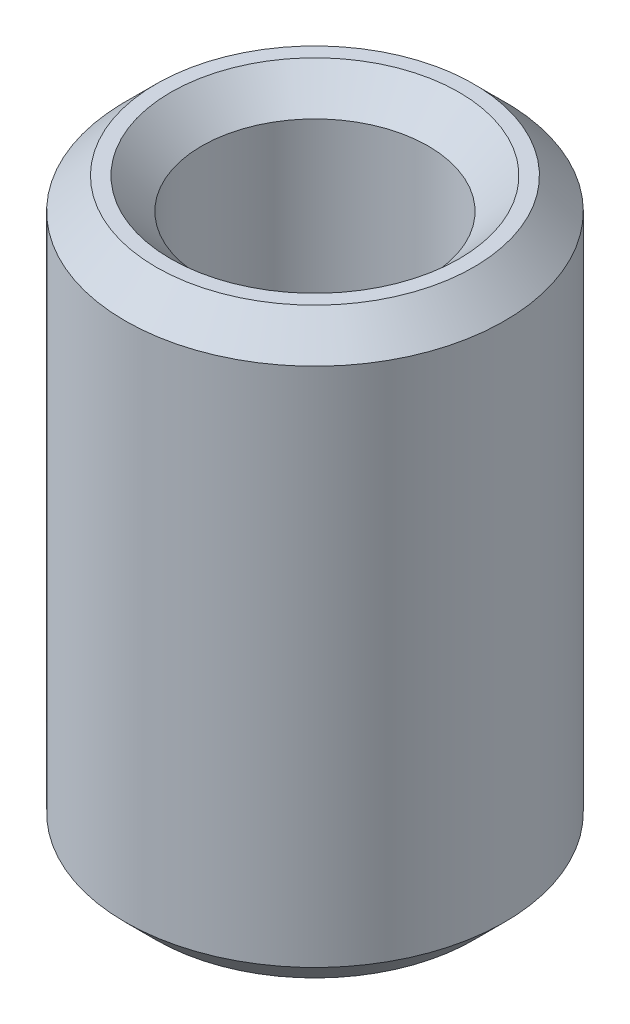
ISO-10303-21;
HEADER;
FILE_DESCRIPTION(('STEP AP214'),'2;1');
FILE_NAME('part.step','',(''),(''),'','','');
FILE_SCHEMA(('AUTOMOTIVE_DESIGN { 1 0 10303 214 1 1 1 1 }'));
ENDSEC;
DATA;
#1=APPLICATION_CONTEXT('core data for automotive mechanical design processes');
#2=APPLICATION_PROTOCOL_DEFINITION('international standard','automotive_design',2000,#1);
#3=PRODUCT_CONTEXT('',#1,'mechanical');
#4=PRODUCT('Part','Part','',(#3));
#5=PRODUCT_RELATED_PRODUCT_CATEGORY('part','',(#4));
#6=PRODUCT_DEFINITION_FORMATION('','',#4);
#7=PRODUCT_DEFINITION_CONTEXT('part definition',#1,'design');
#8=PRODUCT_DEFINITION('design','',#6,#7);
#9=PRODUCT_DEFINITION_SHAPE('','',#8);
#10=(LENGTH_UNIT() NAMED_UNIT(*) SI_UNIT(.MILLI.,.METRE.));
#11=(NAMED_UNIT(*) PLANE_ANGLE_UNIT() SI_UNIT($,.RADIAN.));
#12=(NAMED_UNIT(*) SI_UNIT($,.STERADIAN.) SOLID_ANGLE_UNIT());
#13=UNCERTAINTY_MEASURE_WITH_UNIT(LENGTH_MEASURE(1.E-05),#10,'distance_accuracy_value','');
#14=(GEOMETRIC_REPRESENTATION_CONTEXT(3) GLOBAL_UNCERTAINTY_ASSIGNED_CONTEXT((#13)) GLOBAL_UNIT_ASSIGNED_CONTEXT((#10,
#11,#12)) REPRESENTATION_CONTEXT('',''));
#15=CARTESIAN_POINT('',(0.,0.,0.));
#16=DIRECTION('',(0.,0.,1.));
#17=DIRECTION('',(1.,0.,0.));
#18=AXIS2_PLACEMENT_3D('',#15,#16,#17);
#19=CARTESIAN_POINT('',(0.,69.0912489266011,0.));
#20=DIRECTION('',(0.,-1.,0.));
#21=DIRECTION('',(0.,0.,-1.));
#22=AXIS2_PLACEMENT_3D('',#19,#20,#21);
#23=CYLINDRICAL_SURFACE('',#22,22.5);
#24=CARTESIAN_POINT('',(0.,3.67479648369405,0.));
#25=DIRECTION('',(0.,1.,0.));
#26=DIRECTION('',(0.,0.,1.));
#27=AXIS2_PLACEMENT_3D('',#24,#25,#26);
#28=CIRCLE('',#27,22.5);
#29=CARTESIAN_POINT('',(0.,3.67479648369405,22.5));
#30=VERTEX_POINT('',#29);
#31=EDGE_CURVE('E10',#30,#30,#28,.T.);
#32=ORIENTED_EDGE('',*,*,#31,.T.);
#33=EDGE_LOOP('',(#32));
#34=FACE_BOUND('',#33,.T.);
#35=CARTESIAN_POINT('',(0.,65.416452442907,0.));
#36=DIRECTION('',(0.,1.,0.));
#37=DIRECTION('',(0.,0.,1.));
#38=AXIS2_PLACEMENT_3D('',#35,#36,#37);
#39=CIRCLE('',#38,22.5);
#40=CARTESIAN_POINT('',(0.,65.416452442907,22.5));
#41=VERTEX_POINT('',#40);
#42=EDGE_CURVE('E50',#41,#41,#39,.F.);
#43=ORIENTED_EDGE('',*,*,#42,.T.);
#44=EDGE_LOOP('',(#43));
#45=FACE_BOUND('',#44,.T.);
#46=ADVANCED_FACE('F39',(#34,#45),#23,.T.);
#47=CARTESIAN_POINT('',(0.,69.0912489266011,0.));
#48=DIRECTION('',(0.,1.,0.));
#49=DIRECTION('',(0.,0.,1.));
#50=AXIS2_PLACEMENT_3D('',#47,#48,#49);
#51=PLANE('',#50);
#52=CARTESIAN_POINT('',(0.,69.0912489266011,0.));
#53=DIRECTION('',(0.,1.,0.));
#54=DIRECTION('',(0.,0.,1.));
#55=AXIS2_PLACEMENT_3D('',#52,#53,#54);
#56=CIRCLE('',#55,17.1024564923606);
#57=CARTESIAN_POINT('',(0.,69.0912489266011,17.1024564923606));
#58=VERTEX_POINT('',#57);
#59=EDGE_CURVE('E58',#58,#58,#56,.F.);
#60=ORIENTED_EDGE('',*,*,#59,.T.);
#61=EDGE_LOOP('',(#60));
#62=FACE_BOUND('',#61,.T.);
#63=CARTESIAN_POINT('',(0.,69.0912489266011,0.));
#64=DIRECTION('',(0.,1.,0.));
#65=DIRECTION('',(0.,0.,1.));
#66=AXIS2_PLACEMENT_3D('',#63,#64,#65);
#67=CIRCLE('',#66,18.8252035163059);
#68=CARTESIAN_POINT('',(0.,69.0912489266011,18.8252035163059));
#69=VERTEX_POINT('',#68);
#70=EDGE_CURVE('E61',#69,#69,#67,.T.);
#71=ORIENTED_EDGE('',*,*,#70,.T.);
#72=EDGE_LOOP('',(#71));
#73=FACE_BOUND('',#72,.T.);
#74=ADVANCED_FACE('F88',(#62,#73),#51,.T.);
#75=CARTESIAN_POINT('',(0.,0.,0.));
#76=DIRECTION('',(0.,1.,0.));
#77=DIRECTION('',(0.,0.,1.));
#78=AXIS2_PLACEMENT_3D('',#75,#76,#77);
#79=PLANE('',#78);
#80=CARTESIAN_POINT('',(0.,0.,0.));
#81=DIRECTION('',(0.,1.,0.));
#82=DIRECTION('',(0.,0.,1.));
#83=AXIS2_PLACEMENT_3D('',#80,#81,#82);
#84=CIRCLE('',#83,17.1024564923605);
#85=CARTESIAN_POINT('',(0.,0.,17.1024564923605));
#86=VERTEX_POINT('',#85);
#87=EDGE_CURVE('E51',#86,#86,#84,.T.);
#88=ORIENTED_EDGE('',*,*,#87,.T.);
#89=EDGE_LOOP('',(#88));
#90=FACE_BOUND('',#89,.T.);
#91=CARTESIAN_POINT('',(0.,0.,0.));
#92=DIRECTION('',(0.,1.,0.));
#93=DIRECTION('',(0.,0.,1.));
#94=AXIS2_PLACEMENT_3D('',#91,#92,#93);
#95=CIRCLE('',#94,18.8252035163059);
#96=CARTESIAN_POINT('',(0.,0.,18.8252035163059));
#97=VERTEX_POINT('',#96);
#98=EDGE_CURVE('E54',#97,#97,#95,.F.);
#99=ORIENTED_EDGE('',*,*,#98,.T.);
#100=EDGE_LOOP('',(#99));
#101=FACE_BOUND('',#100,.T.);
#102=ADVANCED_FACE('F83',(#90,#101),#79,.F.);
#103=CARTESIAN_POINT('',(0.,69.0912489266011,0.));
#104=DIRECTION('',(0.,-1.,0.));
#105=DIRECTION('',(0.,0.,-1.));
#106=AXIS2_PLACEMENT_3D('',#103,#104,#105);
#107=CYLINDRICAL_SURFACE('',#106,13.4276600086665);
#108=CARTESIAN_POINT('',(0.,65.416452442907,0.));
#109=DIRECTION('',(0.,1.,0.));
#110=DIRECTION('',(0.,0.,1.));
#111=AXIS2_PLACEMENT_3D('',#108,#109,#110);
#112=CIRCLE('',#111,13.4276600086665);
#113=CARTESIAN_POINT('',(0.,65.416452442907,13.4276600086665));
#114=VERTEX_POINT('',#113);
#115=EDGE_CURVE('E67',#114,#114,#112,.T.);
#116=ORIENTED_EDGE('',*,*,#115,.T.);
#117=EDGE_LOOP('',(#116));
#118=FACE_BOUND('',#117,.T.);
#119=CARTESIAN_POINT('',(0.,3.67479648369408,0.));
#120=DIRECTION('',(0.,1.,0.));
#121=DIRECTION('',(0.,0.,1.));
#122=AXIS2_PLACEMENT_3D('',#119,#120,#121);
#123=CIRCLE('',#122,13.4276600086665);
#124=CARTESIAN_POINT('',(0.,3.67479648369408,13.4276600086665));
#125=VERTEX_POINT('',#124);
#126=EDGE_CURVE('E69',#125,#125,#123,.F.);
#127=ORIENTED_EDGE('',*,*,#126,.T.);
#128=EDGE_LOOP('',(#127));
#129=FACE_BOUND('',#128,.T.);
#130=ADVANCED_FACE('F71',(#118,#129),#107,.F.);
#131=CARTESIAN_POINT('',(0.,65.416452442907,0.));
#132=DIRECTION('',(0.,1.,0.));
#133=DIRECTION('',(0.,0.,1.));
#134=AXIS2_PLACEMENT_3D('',#131,#132,#133);
#135=CONICAL_SURFACE('',#134,13.4276600086665,0.785398163397453);
#136=CARTESIAN_POINT('',(0.,69.0912489266011,17.1024564923606));
#137=CARTESIAN_POINT('',(0.,69.0529697965626,17.0641773623221));
#138=CARTESIAN_POINT('',(0.,69.0146906665241,17.0258982322836));
#139=CARTESIAN_POINT('',(0.,68.9381324064471,16.9493399722066));
#140=CARTESIAN_POINT('',(0.,68.8998532764087,16.9110608421682));
#141=CARTESIAN_POINT('',(0.,68.8232950163317,16.8345025820912));
#142=CARTESIAN_POINT('',(0.,68.7850158862932,16.7962234520527));
#143=CARTESIAN_POINT('',(0.,68.7084576262163,16.7196651919758));
#144=CARTESIAN_POINT('',(0.,68.6701784961778,16.6813860619373));
#145=CARTESIAN_POINT('',(0.,68.5936202361008,16.6048278018603));
#146=CARTESIAN_POINT('',(0.,68.5553411060623,16.5665486718218));
#147=CARTESIAN_POINT('',(0.,68.4787828459854,16.4899904117449));
#148=CARTESIAN_POINT('',(0.,68.4405037159469,16.4517112817064));
#149=CARTESIAN_POINT('',(0.,68.36394545587,16.3751530216294));
#150=CARTESIAN_POINT('',(0.,68.3256663258315,16.336873891591));
#151=CARTESIAN_POINT('',(0.,68.2491080657545,16.260315631514));
#152=CARTESIAN_POINT('',(0.,68.210828935716,16.2220365014755));
#153=CARTESIAN_POINT('',(0.,68.1342706756391,16.1454782413986));
#154=CARTESIAN_POINT('',(0.,68.0959915456006,16.1071991113601));
#155=CARTESIAN_POINT('',(0.,68.0194332855236,16.0306408512831));
#156=CARTESIAN_POINT('',(0.,67.9811541554852,15.9923617212446));
#157=CARTESIAN_POINT('',(0.,67.9045958954082,15.9158034611677));
#158=CARTESIAN_POINT('',(0.,67.8663167653697,15.8775243311292));
#159=CARTESIAN_POINT('',(0.,67.7897585052928,15.8009660710522));
#160=CARTESIAN_POINT('',(0.,67.7514793752543,15.7626869410138));
#161=CARTESIAN_POINT('',(0.,67.6749211151773,15.6861286809368));
#162=CARTESIAN_POINT('',(0.,67.6366419851388,15.6478495508983));
#163=CARTESIAN_POINT('',(0.,67.5600837250619,15.5712912908214));
#164=CARTESIAN_POINT('',(0.,67.5218045950234,15.5330121607829));
#165=CARTESIAN_POINT('',(0.,67.4452463349464,15.4564539007059));
#166=CARTESIAN_POINT('',(0.,67.406967204908,15.4181747706674));
#167=CARTESIAN_POINT('',(0.,67.330408944831,15.3416165105905));
#168=CARTESIAN_POINT('',(0.,67.2921298147925,15.303337380552));
#169=CARTESIAN_POINT('',(0.,67.2155715547156,15.226779120475));
#170=CARTESIAN_POINT('',(0.,67.1772924246771,15.1884999904366));
#171=CARTESIAN_POINT('',(0.,67.1007341646001,15.1119417303596));
#172=CARTESIAN_POINT('',(0.,67.0624550345617,15.0736626003211));
#173=CARTESIAN_POINT('',(0.,66.9858967744847,14.9971043402442));
#174=CARTESIAN_POINT('',(0.,66.9476176444462,14.9588252102057));
#175=CARTESIAN_POINT('',(0.,66.8710593843692,14.8822669501287));
#176=CARTESIAN_POINT('',(0.,66.8327802543308,14.8439878200902));
#177=CARTESIAN_POINT('',(0.,66.7562219942538,14.7674295600133));
#178=CARTESIAN_POINT('',(0.,66.7179428642153,14.7291504299748));
#179=CARTESIAN_POINT('',(0.,66.6413846041384,14.6525921698979));
#180=CARTESIAN_POINT('',(0.,66.6031054740999,14.6143130398594));
#181=CARTESIAN_POINT('',(0.,66.5265472140229,14.5377547797824));
#182=CARTESIAN_POINT('',(0.,66.4882680839845,14.4994756497439));
#183=CARTESIAN_POINT('',(0.,66.4117098239075,14.422917389667));
#184=CARTESIAN_POINT('',(0.,66.373430693869,14.3846382596285));
#185=CARTESIAN_POINT('',(0.,66.296872433792,14.3080799995515));
#186=CARTESIAN_POINT('',(0.,66.2585933037536,14.269800869513));
#187=CARTESIAN_POINT('',(0.,66.1820350436766,14.1932426094361));
#188=CARTESIAN_POINT('',(0.,66.1437559136381,14.1549634793976));
#189=CARTESIAN_POINT('',(0.,66.0671976535612,14.0784052193207));
#190=CARTESIAN_POINT('',(0.,66.0289185235227,14.0401260892822));
#191=CARTESIAN_POINT('',(0.,65.9523602634457,13.9635678292052));
#192=CARTESIAN_POINT('',(0.,65.9140811334073,13.9252886991667));
#193=CARTESIAN_POINT('',(0.,65.8375228733303,13.8487304390898));
#194=CARTESIAN_POINT('',(0.,65.7992437432918,13.8104513090513));
#195=CARTESIAN_POINT('',(0.,65.7226854832149,13.7338930489743));
#196=CARTESIAN_POINT('',(0.,65.6844063531764,13.6956139189358));
#197=CARTESIAN_POINT('',(0.,65.6078480930994,13.6190556588589));
#198=CARTESIAN_POINT('',(0.,65.5695689630609,13.5807765288204));
#199=CARTESIAN_POINT('',(0.,65.493010702984,13.5042182687434));
#200=CARTESIAN_POINT('',(0.,65.4547315729455,13.465939138705));
#201=CARTESIAN_POINT('',(0.,65.416452442907,13.4276600086665));
#202=B_SPLINE_CURVE_WITH_KNOTS('',3,(#136,#137,#138,#139,#140,#141,#142,#143,#144,#145,#146,
#147,#148,#149,#150,#151,#152,#153,#154,#155,#156,#157,#158,#159,#160,#161,#162,#163,#164,#165,
#166,#167,#168,#169,#170,#171,#172,#173,#174,#175,#176,#177,#178,#179,#180,#181,#182,#183,#184,
#185,#186,#187,#188,#189,#190,#191,#192,#193,#194,#195,#196,#197,#198,#199,#200,#201),
.UNSPECIFIED.,.F.,.F.,(4,2,2,2,2,2,2,2,2,2,2,2,2,2,2,2,2,2,2,2,2,2,2,2,2,2,2,2,2,2,2,2,4),(0.,
0.16240459456878,0.324809189137559,0.487213783706349,0.649618378275128,0.812022972843918,
0.974427567412698,1.13683216198149,1.29923675655027,1.46164135111905,1.62404594568784,
1.78645054025662,1.94885513482541,2.11125972939419,2.27366432396298,2.43606891853176,
2.59847351310055,2.76087810766933,2.92328270223811,3.0856872968069,3.24809189137568,
3.41049648594446,3.57290108051324,3.73530567508204,3.89771026965082,4.06011486421959,
4.22251945878838,4.38492405335716,4.54732864792595,4.70973324249473,4.87213783706352,
5.0345424316323,5.19694702620108),.UNSPECIFIED.);
#203=EDGE_CURVE('BSEAM77',#58,#114,#202,.T.);
#204=ORIENTED_EDGE('',*,*,#59,.F.);
#205=ORIENTED_EDGE('',*,*,#115,.F.);
#206=ORIENTED_EDGE('',*,*,#203,.T.);
#207=ORIENTED_EDGE('',*,*,#203,.F.);
#208=EDGE_LOOP('',(#204,#206,#205,#207));
#209=FACE_BOUND('',#208,.T.);
#210=ADVANCED_FACE('F77',(#209),#135,.F.);
#211=CARTESIAN_POINT('',(0.,0.,0.));
#212=DIRECTION('',(0.,-1.,0.));
#213=DIRECTION('',(0.,0.,-1.));
#214=AXIS2_PLACEMENT_3D('',#211,#212,#213);
#215=CONICAL_SURFACE('',#214,17.1024564923605,0.785398163397445);
#216=ORIENTED_EDGE('',*,*,#126,.F.);
#217=EDGE_LOOP('',(#216));
#218=FACE_BOUND('',#217,.T.);
#219=ORIENTED_EDGE('',*,*,#87,.F.);
#220=EDGE_LOOP('',(#219));
#221=FACE_BOUND('',#220,.T.);
#222=ADVANCED_FACE('F73',(#218,#221),#215,.F.);
#223=CARTESIAN_POINT('',(0.,3.67479648369405,0.));
#224=DIRECTION('',(0.,1.,0.));
#225=DIRECTION('',(0.,0.,1.));
#226=AXIS2_PLACEMENT_3D('',#223,#224,#225);
#227=CONICAL_SURFACE('',#226,22.5,0.785398163397452);
#228=CARTESIAN_POINT('',(0.,0.,18.8252035163059));
#229=CARTESIAN_POINT('',(0.,0.0382791300384792,18.8634826463444));
#230=CARTESIAN_POINT('',(0.,0.0765582600769589,18.9017617763829));
#231=CARTESIAN_POINT('',(0.,0.153116520153918,18.9783200364598));
#232=CARTESIAN_POINT('',(0.,0.191395650192398,19.0165991664983));
#233=CARTESIAN_POINT('',(0.,0.267953910269357,19.0931574265753));
#234=CARTESIAN_POINT('',(0.,0.306233040307837,19.1314365566138));
#235=CARTESIAN_POINT('',(0.,0.382791300384797,19.2079948166907));
#236=CARTESIAN_POINT('',(0.,0.421070430423276,19.2462739467292));
#237=CARTESIAN_POINT('',(0.,0.497628690500236,19.3228322068062));
#238=CARTESIAN_POINT('',(0.,0.535907820538716,19.3611113368446));
#239=CARTESIAN_POINT('',(0.,0.612466080615675,19.4376695969216));
#240=CARTESIAN_POINT('',(0.,0.650745210654154,19.4759487269601));
#241=CARTESIAN_POINT('',(0.,0.727303470731113,19.552506987037));
#242=CARTESIAN_POINT('',(0.,0.765582600769594,19.5907861170755));
#243=CARTESIAN_POINT('',(0.,0.842140860846553,19.6673443771525));
#244=CARTESIAN_POINT('',(0.,0.880419990885033,19.705623507191));
#245=CARTESIAN_POINT('',(0.,0.956978250961992,19.7821817672679));
#246=CARTESIAN_POINT('',(0.,0.995257381000472,19.8204608973064));
#247=CARTESIAN_POINT('',(0.,1.07181564107743,19.8970191573834));
#248=CARTESIAN_POINT('',(0.,1.11009477111591,19.9352982874218));
#249=CARTESIAN_POINT('',(0.,1.18665303119287,20.0118565474988));
#250=CARTESIAN_POINT('',(0.,1.22493216123135,20.0501356775373));
#251=CARTESIAN_POINT('',(0.,1.30149042130831,20.1266939376142));
#252=CARTESIAN_POINT('',(0.,1.33976955134679,20.1649730676527));
#253=CARTESIAN_POINT('',(0.,1.41632781142375,20.2415313277297));
#254=CARTESIAN_POINT('',(0.,1.45460694146223,20.2798104577682));
#255=CARTESIAN_POINT('',(0.,1.53116520153919,20.3563687178451));
#256=CARTESIAN_POINT('',(0.,1.56944433157767,20.3946478478836));
#257=CARTESIAN_POINT('',(0.,1.64600259165463,20.4712061079606));
#258=CARTESIAN_POINT('',(0.,1.68428172169311,20.509485237999));
#259=CARTESIAN_POINT('',(0.,1.76083998177007,20.586043498076));
#260=CARTESIAN_POINT('',(0.,1.79911911180855,20.6243226281145));
#261=CARTESIAN_POINT('',(0.,1.8756773718855,20.7008808881914));
#262=CARTESIAN_POINT('',(0.,1.91395650192398,20.7391600182299));
#263=CARTESIAN_POINT('',(0.,1.99051476200094,20.8157182783069));
#264=CARTESIAN_POINT('',(0.,2.02879389203942,20.8539974083454));
#265=CARTESIAN_POINT('',(0.,2.10535215211638,20.9305556684223));
#266=CARTESIAN_POINT('',(0.,2.14363128215486,20.9688347984608));
#267=CARTESIAN_POINT('',(0.,2.22018954223182,21.0453930585378));
#268=CARTESIAN_POINT('',(0.,2.2584686722703,21.0836721885762));
#269=CARTESIAN_POINT('',(0.,2.33502693234726,21.1602304486532));
#270=CARTESIAN_POINT('',(0.,2.37330606238574,21.1985095786917));
#271=CARTESIAN_POINT('',(0.,2.4498643224627,21.2750678387686));
#272=CARTESIAN_POINT('',(0.,2.48814345250118,21.3133469688071));
#273=CARTESIAN_POINT('',(0.,2.56470171257814,21.3899052288841));
#274=CARTESIAN_POINT('',(0.,2.60298084261662,21.4281843589226));
#275=CARTESIAN_POINT('',(0.,2.67953910269358,21.5047426189995));
#276=CARTESIAN_POINT('',(0.,2.71781823273206,21.543021749038));
#277=CARTESIAN_POINT('',(0.,2.79437649280902,21.619580009115));
#278=CARTESIAN_POINT('',(0.,2.8326556228475,21.6578591391534));
#279=CARTESIAN_POINT('',(0.,2.90921388292446,21.7344173992304));
#280=CARTESIAN_POINT('',(0.,2.94749301296294,21.7726965292689));
#281=CARTESIAN_POINT('',(0.,3.0240512730399,21.8492547893458));
#282=CARTESIAN_POINT('',(0.,3.06233040307838,21.8875339193843));
#283=CARTESIAN_POINT('',(0.,3.13888866315533,21.9640921794613));
#284=CARTESIAN_POINT('',(0.,3.17716779319381,22.0023713094998));
#285=CARTESIAN_POINT('',(0.,3.25372605327077,22.0789295695767));
#286=CARTESIAN_POINT('',(0.,3.29200518330925,22.1172086996152));
#287=CARTESIAN_POINT('',(0.,3.36856344338621,22.1937669596922));
#288=CARTESIAN_POINT('',(0.,3.40684257342469,22.2320460897306));
#289=CARTESIAN_POINT('',(0.,3.48340083350165,22.3086043498076));
#290=CARTESIAN_POINT('',(0.,3.52167996354013,22.3468834798461));
#291=CARTESIAN_POINT('',(0.,3.59823822361709,22.423441739923));
#292=CARTESIAN_POINT('',(0.,3.63651735365557,22.4617208699615));
#293=CARTESIAN_POINT('',(0.,3.67479648369405,22.5));
#294=B_SPLINE_CURVE_WITH_KNOTS('',3,(#228,#229,#230,#231,#232,#233,#234,#235,#236,#237,#238,
#239,#240,#241,#242,#243,#244,#245,#246,#247,#248,#249,#250,#251,#252,#253,#254,#255,#256,#257,
#258,#259,#260,#261,#262,#263,#264,#265,#266,#267,#268,#269,#270,#271,#272,#273,#274,#275,#276,
#277,#278,#279,#280,#281,#282,#283,#284,#285,#286,#287,#288,#289,#290,#291,#292,#293),
.UNSPECIFIED.,.F.,.F.,(4,2,2,2,2,2,2,2,2,2,2,2,2,2,2,2,2,2,2,2,2,2,2,2,2,2,2,2,2,2,2,2,4),(0.,
0.162404594568784,0.324809189137569,0.487213783706353,0.649618378275137,0.812022972843921,
0.974427567412708,1.13683216198149,1.29923675655028,1.46164135111906,1.62404594568785,
1.78645054025663,1.94885513482541,2.1112597293942,2.27366432396298,2.43606891853177,
2.59847351310055,2.76087810766934,2.92328270223812,3.08568729680691,3.24809189137569,
3.41049648594448,3.57290108051326,3.73530567508205,3.89771026965083,4.06011486421961,
4.2225194587884,4.38492405335718,4.54732864792597,4.70973324249475,4.87213783706354,
5.03454243163232,5.19694702620111),.UNSPECIFIED.);
#295=EDGE_CURVE('BSEAM76',#97,#30,#294,.T.);
#296=ORIENTED_EDGE('',*,*,#98,.F.);
#297=ORIENTED_EDGE('',*,*,#31,.F.);
#298=ORIENTED_EDGE('',*,*,#295,.T.);
#299=ORIENTED_EDGE('',*,*,#295,.F.);
#300=EDGE_LOOP('',(#296,#298,#297,#299));
#301=FACE_BOUND('',#300,.T.);
#302=ADVANCED_FACE('F76',(#301),#227,.T.);
#303=CARTESIAN_POINT('',(0.,69.0912489266011,0.));
#304=DIRECTION('',(0.,-1.,0.));
#305=DIRECTION('',(0.,0.,-1.));
#306=AXIS2_PLACEMENT_3D('',#303,#304,#305);
#307=CONICAL_SURFACE('',#306,18.8252035163059,0.785398163397444);
#308=ORIENTED_EDGE('',*,*,#42,.F.);
#309=EDGE_LOOP('',(#308));
#310=FACE_BOUND('',#309,.T.);
#311=ORIENTED_EDGE('',*,*,#70,.F.);
#312=EDGE_LOOP('',(#311));
#313=FACE_BOUND('',#312,.T.);
#314=ADVANCED_FACE('F45',(#310,#313),#307,.T.);
#315=CLOSED_SHELL('',(#46,#74,#102,#130,#210,#222,#302,#314));
#316=MANIFOLD_SOLID_BREP('B2',#315);
#317=ADVANCED_BREP_SHAPE_REPRESENTATION('',(#18,#316),#14);
#318=SHAPE_DEFINITION_REPRESENTATION(#9,#317);
ENDSEC;
END-ISO-10303-21;
